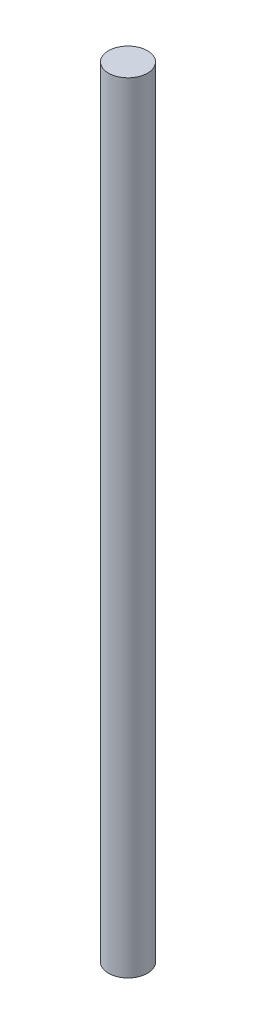
ISO-10303-21;
HEADER;
FILE_DESCRIPTION(('STEP AP214'),'2;1');
FILE_NAME('part.step','',(''),(''),'','','');
FILE_SCHEMA(('AUTOMOTIVE_DESIGN { 1 0 10303 214 1 1 1 1 }'));
ENDSEC;
DATA;
#1=APPLICATION_CONTEXT('core data for automotive mechanical design processes');
#2=APPLICATION_PROTOCOL_DEFINITION('international standard','automotive_design',2000,#1);
#3=PRODUCT_CONTEXT('',#1,'mechanical');
#4=PRODUCT('Part','Part','',(#3));
#5=PRODUCT_RELATED_PRODUCT_CATEGORY('part','',(#4));
#6=PRODUCT_DEFINITION_FORMATION('','',#4);
#7=PRODUCT_DEFINITION_CONTEXT('part definition',#1,'design');
#8=PRODUCT_DEFINITION('design','',#6,#7);
#9=PRODUCT_DEFINITION_SHAPE('','',#8);
#10=(LENGTH_UNIT() NAMED_UNIT(*) SI_UNIT(.MILLI.,.METRE.));
#11=(NAMED_UNIT(*) PLANE_ANGLE_UNIT() SI_UNIT($,.RADIAN.));
#12=(NAMED_UNIT(*) SI_UNIT($,.STERADIAN.) SOLID_ANGLE_UNIT());
#13=UNCERTAINTY_MEASURE_WITH_UNIT(LENGTH_MEASURE(1.E-05),#10,'distance_accuracy_value','');
#14=(GEOMETRIC_REPRESENTATION_CONTEXT(3) GLOBAL_UNCERTAINTY_ASSIGNED_CONTEXT((#13)) GLOBAL_UNIT_ASSIGNED_CONTEXT((#10,
#11,#12)) REPRESENTATION_CONTEXT('',''));
#15=CARTESIAN_POINT('',(0.,0.,0.));
#16=DIRECTION('',(0.,0.,1.));
#17=DIRECTION('',(1.,0.,0.));
#18=AXIS2_PLACEMENT_3D('',#15,#16,#17);
#19=CARTESIAN_POINT('',(0.,400.,0.));
#20=DIRECTION('',(0.,-1.,0.));
#21=DIRECTION('',(0.,0.,-1.));
#22=AXIS2_PLACEMENT_3D('',#19,#20,#21);
#23=CYLINDRICAL_SURFACE('',#22,10.);
#24=CARTESIAN_POINT('',(0.,400.,0.));
#25=DIRECTION('',(0.,1.,0.));
#26=DIRECTION('',(0.,0.,1.));
#27=AXIS2_PLACEMENT_3D('',#24,#25,#26);
#28=CIRCLE('',#27,10.);
#29=CARTESIAN_POINT('',(0.,400.,10.));
#30=VERTEX_POINT('',#29);
#31=EDGE_CURVE('E10',#30,#30,#28,.T.);
#32=ORIENTED_EDGE('',*,*,#31,.F.);
#33=EDGE_LOOP('',(#32));
#34=FACE_BOUND('',#33,.T.);
#35=CARTESIAN_POINT('',(0.,0.,0.));
#36=DIRECTION('',(0.,1.,0.));
#37=DIRECTION('',(0.,0.,1.));
#38=AXIS2_PLACEMENT_3D('',#35,#36,#37);
#39=CIRCLE('',#38,10.);
#40=CARTESIAN_POINT('',(0.,0.,10.));
#41=VERTEX_POINT('',#40);
#42=EDGE_CURVE('E33',#41,#41,#39,.T.);
#43=ORIENTED_EDGE('',*,*,#42,.T.);
#44=EDGE_LOOP('',(#43));
#45=FACE_BOUND('',#44,.T.);
#46=ADVANCED_FACE('F30',(#34,#45),#23,.T.);
#47=CARTESIAN_POINT('',(0.,400.,0.));
#48=DIRECTION('',(0.,1.,0.));
#49=DIRECTION('',(0.,0.,1.));
#50=AXIS2_PLACEMENT_3D('',#47,#48,#49);
#51=PLANE('',#50);
#52=ORIENTED_EDGE('',*,*,#31,.T.);
#53=EDGE_LOOP('',(#52));
#54=FACE_BOUND('',#53,.T.);
#55=ADVANCED_FACE('F45',(#54),#51,.T.);
#56=CARTESIAN_POINT('',(0.,0.,0.));
#57=DIRECTION('',(0.,1.,0.));
#58=DIRECTION('',(0.,0.,1.));
#59=AXIS2_PLACEMENT_3D('',#56,#57,#58);
#60=PLANE('',#59);
#61=ORIENTED_EDGE('',*,*,#42,.F.);
#62=EDGE_LOOP('',(#61));
#63=FACE_BOUND('',#62,.T.);
#64=ADVANCED_FACE('F43',(#63),#60,.F.);
#65=CLOSED_SHELL('',(#46,#55,#64));
#66=MANIFOLD_SOLID_BREP('B2',#65);
#67=ADVANCED_BREP_SHAPE_REPRESENTATION('',(#18,#66),#14);
#68=SHAPE_DEFINITION_REPRESENTATION(#9,#67);
ENDSEC;
END-ISO-10303-21;
